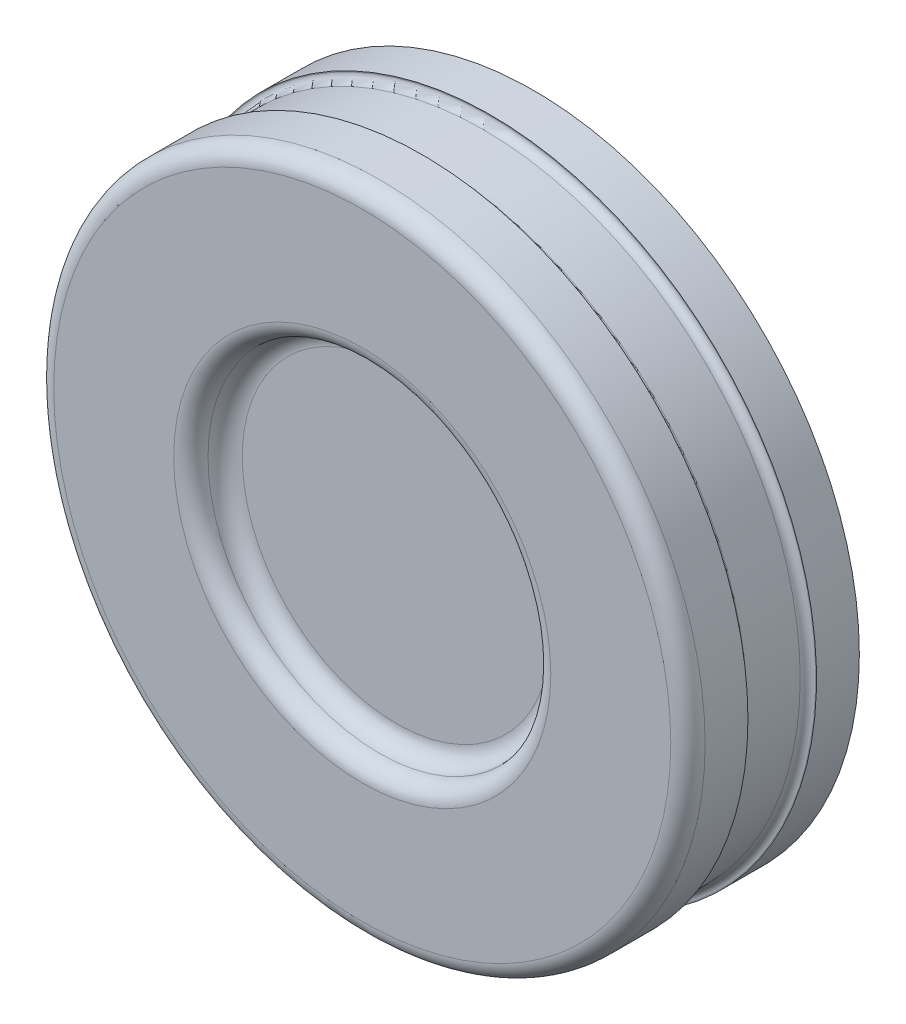
ISO-10303-21;
HEADER;
FILE_DESCRIPTION(('STEP AP214'),'2;1');
FILE_NAME('part.step','',(''),(''),'','','');
FILE_SCHEMA(('AUTOMOTIVE_DESIGN { 1 0 10303 214 1 1 1 1 }'));
ENDSEC;
DATA;
#1=APPLICATION_CONTEXT('core data for automotive mechanical design processes');
#2=APPLICATION_PROTOCOL_DEFINITION('international standard','automotive_design',2000,#1);
#3=PRODUCT_CONTEXT('',#1,'mechanical');
#4=PRODUCT('Part','Part','',(#3));
#5=PRODUCT_RELATED_PRODUCT_CATEGORY('part','',(#4));
#6=PRODUCT_DEFINITION_FORMATION('','',#4);
#7=PRODUCT_DEFINITION_CONTEXT('part definition',#1,'design');
#8=PRODUCT_DEFINITION('design','',#6,#7);
#9=PRODUCT_DEFINITION_SHAPE('','',#8);
#10=(LENGTH_UNIT() NAMED_UNIT(*) SI_UNIT(.MILLI.,.METRE.));
#11=(NAMED_UNIT(*) PLANE_ANGLE_UNIT() SI_UNIT($,.RADIAN.));
#12=(NAMED_UNIT(*) SI_UNIT($,.STERADIAN.) SOLID_ANGLE_UNIT());
#13=UNCERTAINTY_MEASURE_WITH_UNIT(LENGTH_MEASURE(1.E-05),#10,'distance_accuracy_value','');
#14=(GEOMETRIC_REPRESENTATION_CONTEXT(3) GLOBAL_UNCERTAINTY_ASSIGNED_CONTEXT((#13)) GLOBAL_UNIT_ASSIGNED_CONTEXT((#10,
#11,#12)) REPRESENTATION_CONTEXT('',''));
#15=CARTESIAN_POINT('',(0.,0.,0.));
#16=DIRECTION('',(0.,0.,1.));
#17=DIRECTION('',(1.,0.,0.));
#18=AXIS2_PLACEMENT_3D('',#15,#16,#17);
#19=CARTESIAN_POINT('',(0.,0.,10.));
#20=DIRECTION('',(0.,0.,-1.));
#21=DIRECTION('',(-1.,0.,0.));
#22=AXIS2_PLACEMENT_3D('',#19,#20,#21);
#23=CYLINDRICAL_SURFACE('',#22,19.);
#24=CARTESIAN_POINT('',(0.,0.,6.5));
#25=DIRECTION('',(0.,0.,1.));
#26=DIRECTION('',(1.,0.,0.));
#27=AXIS2_PLACEMENT_3D('',#24,#25,#26);
#28=CIRCLE('',#27,19.);
#29=CARTESIAN_POINT('',(19.,0.,6.5));
#30=VERTEX_POINT('',#29);
#31=EDGE_CURVE('E58',#30,#30,#28,.T.);
#32=ORIENTED_EDGE('',*,*,#31,.T.);
#33=EDGE_LOOP('',(#32));
#34=FACE_BOUND('',#33,.T.);
#35=CARTESIAN_POINT('',(0.,0.,9.));
#36=DIRECTION('',(0.,0.,1.));
#37=DIRECTION('',(1.,0.,0.));
#38=AXIS2_PLACEMENT_3D('',#35,#36,#37);
#39=CIRCLE('',#38,19.);
#40=CARTESIAN_POINT('',(19.,0.,9.));
#41=VERTEX_POINT('',#40);
#42=EDGE_CURVE('E53',#41,#41,#39,.F.);
#43=ORIENTED_EDGE('',*,*,#42,.T.);
#44=EDGE_LOOP('',(#43));
#45=FACE_BOUND('',#44,.T.);
#46=ADVANCED_FACE('F33',(#34,#45),#23,.T.);
#47=CARTESIAN_POINT('',(0.,0.,10.));
#48=DIRECTION('',(0.,0.,1.));
#49=DIRECTION('',(1.,0.,0.));
#50=AXIS2_PLACEMENT_3D('',#47,#48,#49);
#51=PLANE('',#50);
#52=CARTESIAN_POINT('',(0.,0.,10.));
#53=DIRECTION('',(0.,0.,1.));
#54=DIRECTION('',(1.,0.,0.));
#55=AXIS2_PLACEMENT_3D('',#52,#53,#54);
#56=CIRCLE('',#55,11.);
#57=CARTESIAN_POINT('',(11.,0.,10.));
#58=VERTEX_POINT('',#57);
#59=EDGE_CURVE('E66',#58,#58,#56,.F.);
#60=ORIENTED_EDGE('',*,*,#59,.T.);
#61=EDGE_LOOP('',(#60));
#62=FACE_BOUND('',#61,.T.);
#63=CARTESIAN_POINT('',(0.,0.,10.));
#64=DIRECTION('',(0.,0.,1.));
#65=DIRECTION('',(1.,0.,0.));
#66=AXIS2_PLACEMENT_3D('',#63,#64,#65);
#67=CIRCLE('',#66,18.);
#68=CARTESIAN_POINT('',(18.,0.,10.));
#69=VERTEX_POINT('',#68);
#70=EDGE_CURVE('E69',#69,#69,#67,.T.);
#71=ORIENTED_EDGE('',*,*,#70,.T.);
#72=EDGE_LOOP('',(#71));
#73=FACE_BOUND('',#72,.T.);
#74=ADVANCED_FACE('F98',(#62,#73),#51,.T.);
#75=CARTESIAN_POINT('',(0.,0.,8.));
#76=DIRECTION('',(0.,0.,1.));
#77=DIRECTION('',(1.,0.,0.));
#78=AXIS2_PLACEMENT_3D('',#75,#76,#77);
#79=PLANE('',#78);
#80=CARTESIAN_POINT('',(0.,0.,8.));
#81=DIRECTION('',(0.,0.,1.));
#82=DIRECTION('',(1.,0.,0.));
#83=AXIS2_PLACEMENT_3D('',#80,#81,#82);
#84=CIRCLE('',#83,9.);
#85=CARTESIAN_POINT('',(9.,0.,8.));
#86=VERTEX_POINT('',#85);
#87=EDGE_CURVE('E72',#86,#86,#84,.T.);
#88=ORIENTED_EDGE('',*,*,#87,.T.);
#89=EDGE_LOOP('',(#88));
#90=FACE_BOUND('',#89,.T.);
#91=ADVANCED_FACE('F103',(#90),#79,.T.);
#92=CARTESIAN_POINT('',(0.,0.,9.));
#93=DIRECTION('',(0.,0.,1.));
#94=DIRECTION('',(1.,0.,0.));
#95=AXIS2_PLACEMENT_3D('',#92,#93,#94);
#96=TOROIDAL_SURFACE('',#95,11.,1.);
#97=ORIENTED_EDGE('',*,*,#59,.F.);
#98=EDGE_LOOP('',(#97));
#99=FACE_BOUND('',#98,.T.);
#100=CARTESIAN_POINT('',(0.,0.,9.));
#101=DIRECTION('',(0.,0.,1.));
#102=DIRECTION('',(1.,0.,0.));
#103=AXIS2_PLACEMENT_3D('',#100,#101,#102);
#104=CIRCLE('',#103,10.);
#105=CARTESIAN_POINT('',(10.,0.,9.));
#106=VERTEX_POINT('',#105);
#107=EDGE_CURVE('E57',#106,#106,#104,.T.);
#108=ORIENTED_EDGE('',*,*,#107,.F.);
#109=EDGE_LOOP('',(#108));
#110=FACE_BOUND('',#109,.T.);
#111=ADVANCED_FACE('F111',(#99,#110),#96,.T.);
#112=CARTESIAN_POINT('',(0.,0.,9.));
#113=DIRECTION('',(0.,0.,1.));
#114=DIRECTION('',(1.,0.,0.));
#115=AXIS2_PLACEMENT_3D('',#112,#113,#114);
#116=TOROIDAL_SURFACE('',#115,9.,1.);
#117=ORIENTED_EDGE('',*,*,#107,.T.);
#118=EDGE_LOOP('',(#117));
#119=FACE_BOUND('',#118,.T.);
#120=ORIENTED_EDGE('',*,*,#87,.F.);
#121=EDGE_LOOP('',(#120));
#122=FACE_BOUND('',#121,.T.);
#123=ADVANCED_FACE('F107',(#119,#122),#116,.F.);
#124=CARTESIAN_POINT('',(0.,0.,9.));
#125=DIRECTION('',(0.,0.,1.));
#126=DIRECTION('',(1.,0.,0.));
#127=AXIS2_PLACEMENT_3D('',#124,#125,#126);
#128=TOROIDAL_SURFACE('',#127,18.,1.);
#129=ORIENTED_EDGE('',*,*,#42,.F.);
#130=EDGE_LOOP('',(#129));
#131=FACE_BOUND('',#130,.T.);
#132=ORIENTED_EDGE('',*,*,#70,.F.);
#133=EDGE_LOOP('',(#132));
#134=FACE_BOUND('',#133,.T.);
#135=ADVANCED_FACE('F110',(#131,#134),#128,.T.);
#136=CARTESIAN_POINT('',(-19.5,0.,2.5));
#137=DIRECTION('',(0.,0.,-1.));
#138=DIRECTION('',(-1.,0.,0.));
#139=AXIS2_PLACEMENT_3D('',#136,#137,#138);
#140=PLANE('',#139);
#141=CARTESIAN_POINT('',(0.,0.,2.5));
#142=DIRECTION('',(0.,0.,-1.));
#143=DIRECTION('',(-1.,0.,0.));
#144=AXIS2_PLACEMENT_3D('',#141,#142,#143);
#145=CIRCLE('',#144,18.95);
#146=CARTESIAN_POINT('',(-18.95,0.,2.5));
#147=VERTEX_POINT('',#146);
#148=EDGE_CURVE('E10',#147,#147,#145,.T.);
#149=ORIENTED_EDGE('',*,*,#148,.T.);
#150=EDGE_LOOP('',(#149));
#151=FACE_BOUND('',#150,.T.);
#152=CARTESIAN_POINT('',(0.,0.,2.5));
#153=DIRECTION('',(0.,0.,-1.));
#154=DIRECTION('',(-1.,0.,0.));
#155=AXIS2_PLACEMENT_3D('',#152,#153,#154);
#156=CIRCLE('',#155,19.);
#157=CARTESIAN_POINT('',(-19.,0.,2.5));
#158=VERTEX_POINT('',#157);
#159=EDGE_CURVE('E54',#158,#158,#156,.T.);
#160=ORIENTED_EDGE('',*,*,#159,.F.);
#161=EDGE_LOOP('',(#160));
#162=FACE_BOUND('',#161,.T.);
#163=ADVANCED_FACE('F117',(#151,#162),#140,.F.);
#164=CARTESIAN_POINT('',(-19.5,0.,6.5));
#165=DIRECTION('',(0.,0.,1.));
#166=DIRECTION('',(1.,0.,0.));
#167=AXIS2_PLACEMENT_3D('',#164,#165,#166);
#168=PLANE('',#167);
#169=CARTESIAN_POINT('',(0.,0.,6.5));
#170=DIRECTION('',(0.,0.,1.));
#171=DIRECTION('',(1.,0.,0.));
#172=AXIS2_PLACEMENT_3D('',#169,#170,#171);
#173=CIRCLE('',#172,18.95);
#174=CARTESIAN_POINT('',(18.95,0.,6.5));
#175=VERTEX_POINT('',#174);
#176=EDGE_CURVE('E40',#175,#175,#173,.T.);
#177=ORIENTED_EDGE('',*,*,#176,.T.);
#178=EDGE_LOOP('',(#177));
#179=FACE_BOUND('',#178,.T.);
#180=ORIENTED_EDGE('',*,*,#31,.F.);
#181=EDGE_LOOP('',(#180));
#182=FACE_BOUND('',#181,.T.);
#183=ADVANCED_FACE('F93',(#179,#182),#168,.F.);
#184=CARTESIAN_POINT('',(0.,0.,0.));
#185=DIRECTION('',(0.,0.,-1.));
#186=DIRECTION('',(-1.,0.,0.));
#187=AXIS2_PLACEMENT_3D('',#184,#185,#186);
#188=CYLINDRICAL_SURFACE('',#187,18.5);
#189=CARTESIAN_POINT('',(0.,0.,6.05));
#190=DIRECTION('',(0.,0.,1.));
#191=DIRECTION('',(1.,0.,0.));
#192=AXIS2_PLACEMENT_3D('',#189,#190,#191);
#193=CIRCLE('',#192,18.5);
#194=CARTESIAN_POINT('',(18.5,0.,6.05));
#195=VERTEX_POINT('',#194);
#196=EDGE_CURVE('E44',#195,#195,#193,.F.);
#197=ORIENTED_EDGE('',*,*,#196,.T.);
#198=EDGE_LOOP('',(#197));
#199=FACE_BOUND('',#198,.T.);
#200=CARTESIAN_POINT('',(0.,0.,2.95));
#201=DIRECTION('',(0.,0.,-1.));
#202=DIRECTION('',(-1.,0.,0.));
#203=AXIS2_PLACEMENT_3D('',#200,#201,#202);
#204=CIRCLE('',#203,18.5);
#205=CARTESIAN_POINT('',(-18.5,0.,2.95));
#206=VERTEX_POINT('',#205);
#207=EDGE_CURVE('E48',#206,#206,#204,.F.);
#208=ORIENTED_EDGE('',*,*,#207,.T.);
#209=EDGE_LOOP('',(#208));
#210=FACE_BOUND('',#209,.T.);
#211=ADVANCED_FACE('F82',(#199,#210),#188,.T.);
#212=CARTESIAN_POINT('',(0.,0.,0.));
#213=DIRECTION('',(0.,0.,1.));
#214=DIRECTION('',(1.,0.,0.));
#215=AXIS2_PLACEMENT_3D('',#212,#213,#214);
#216=PLANE('',#215);
#217=CARTESIAN_POINT('',(0.,0.,0.));
#218=DIRECTION('',(0.,0.,1.));
#219=DIRECTION('',(1.,0.,0.));
#220=AXIS2_PLACEMENT_3D('',#217,#218,#219);
#221=CIRCLE('',#220,19.);
#222=CARTESIAN_POINT('',(19.,0.,0.));
#223=VERTEX_POINT('',#222);
#224=EDGE_CURVE('E63',#223,#223,#221,.T.);
#225=ORIENTED_EDGE('',*,*,#224,.F.);
#226=EDGE_LOOP('',(#225));
#227=FACE_BOUND('',#226,.T.);
#228=ADVANCED_FACE('F80',(#227),#216,.F.);
#229=ORIENTED_EDGE('',*,*,#159,.T.);
#230=EDGE_LOOP('',(#229));
#231=FACE_BOUND('',#230,.T.);
#232=ORIENTED_EDGE('',*,*,#224,.T.);
#233=EDGE_LOOP('',(#232));
#234=FACE_BOUND('',#233,.T.);
#235=ADVANCED_FACE('F78',(#231,#234),#23,.T.);
#236=CARTESIAN_POINT('',(0.,0.,6.05));
#237=DIRECTION('',(0.,0.,1.));
#238=DIRECTION('',(1.,0.,0.));
#239=AXIS2_PLACEMENT_3D('',#236,#237,#238);
#240=TOROIDAL_SURFACE('',#239,18.95,0.45);
#241=ORIENTED_EDGE('',*,*,#176,.F.);
#242=EDGE_LOOP('',(#241));
#243=FACE_BOUND('',#242,.T.);
#244=ORIENTED_EDGE('',*,*,#196,.F.);
#245=EDGE_LOOP('',(#244));
#246=FACE_BOUND('',#245,.T.);
#247=ADVANCED_FACE('F89',(#243,#246),#240,.F.);
#248=CARTESIAN_POINT('',(0.,0.,2.95));
#249=DIRECTION('',(0.,0.,-1.));
#250=DIRECTION('',(-1.,0.,0.));
#251=AXIS2_PLACEMENT_3D('',#248,#249,#250);
#252=TOROIDAL_SURFACE('',#251,18.95,0.45);
#253=ORIENTED_EDGE('',*,*,#207,.F.);
#254=EDGE_LOOP('',(#253));
#255=FACE_BOUND('',#254,.T.);
#256=ORIENTED_EDGE('',*,*,#148,.F.);
#257=EDGE_LOOP('',(#256));
#258=FACE_BOUND('',#257,.T.);
#259=ADVANCED_FACE('F35',(#255,#258),#252,.F.);
#260=CLOSED_SHELL('',(#46,#74,#91,#111,#123,#135,#163,#183,#211,#228,#235,#247,#259));
#261=MANIFOLD_SOLID_BREP('B2',#260);
#262=ADVANCED_BREP_SHAPE_REPRESENTATION('',(#18,#261),#14);
#263=SHAPE_DEFINITION_REPRESENTATION(#9,#262);
ENDSEC;
END-ISO-10303-21;
